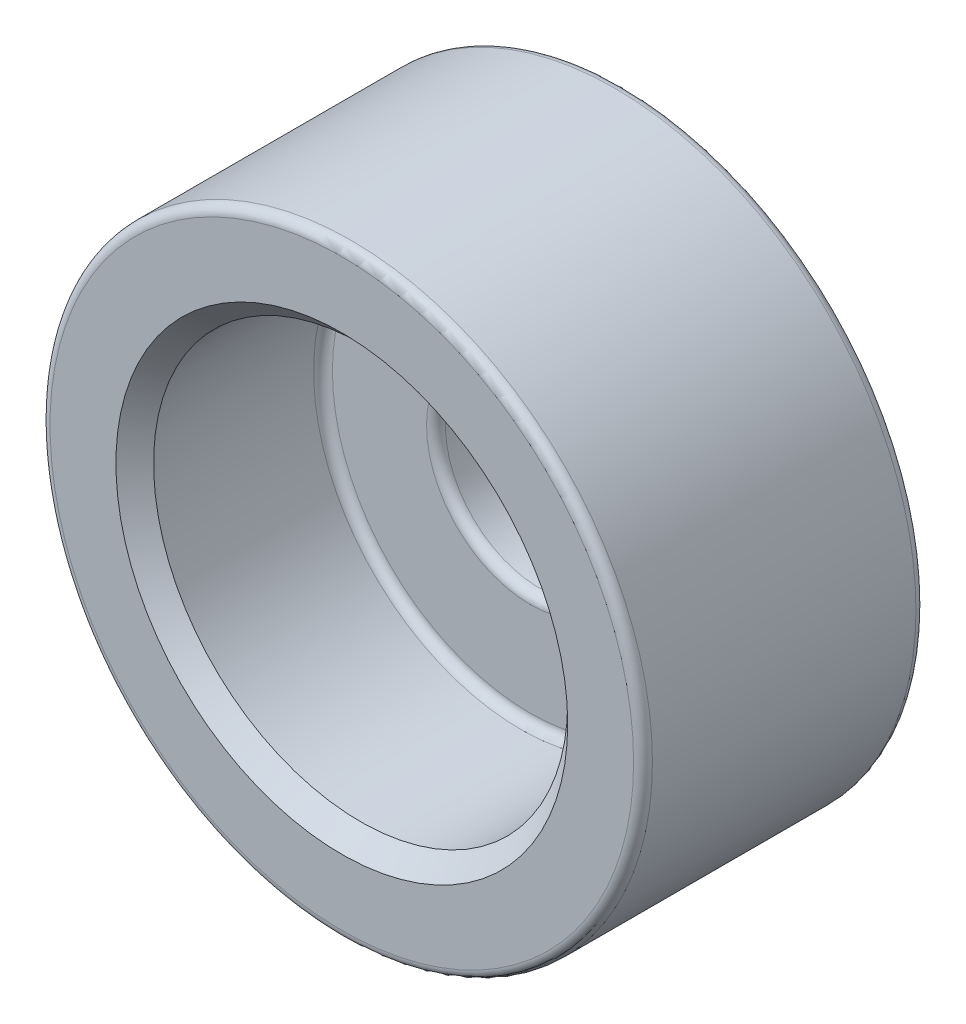
ISO-10303-21;
HEADER;
FILE_DESCRIPTION(('STEP AP214'),'2;1');
FILE_NAME('part.step','',(''),(''),'','','');
FILE_SCHEMA(('AUTOMOTIVE_DESIGN { 1 0 10303 214 1 1 1 1 }'));
ENDSEC;
DATA;
#1=APPLICATION_CONTEXT('core data for automotive mechanical design processes');
#2=APPLICATION_PROTOCOL_DEFINITION('international standard','automotive_design',2000,#1);
#3=PRODUCT_CONTEXT('',#1,'mechanical');
#4=PRODUCT('Part','Part','',(#3));
#5=PRODUCT_RELATED_PRODUCT_CATEGORY('part','',(#4));
#6=PRODUCT_DEFINITION_FORMATION('','',#4);
#7=PRODUCT_DEFINITION_CONTEXT('part definition',#1,'design');
#8=PRODUCT_DEFINITION('design','',#6,#7);
#9=PRODUCT_DEFINITION_SHAPE('','',#8);
#10=(LENGTH_UNIT() NAMED_UNIT(*) SI_UNIT(.MILLI.,.METRE.));
#11=(NAMED_UNIT(*) PLANE_ANGLE_UNIT() SI_UNIT($,.RADIAN.));
#12=(NAMED_UNIT(*) SI_UNIT($,.STERADIAN.) SOLID_ANGLE_UNIT());
#13=UNCERTAINTY_MEASURE_WITH_UNIT(LENGTH_MEASURE(1.E-05),#10,'distance_accuracy_value','');
#14=(GEOMETRIC_REPRESENTATION_CONTEXT(3) GLOBAL_UNCERTAINTY_ASSIGNED_CONTEXT((#13)) GLOBAL_UNIT_ASSIGNED_CONTEXT((#10,
#11,#12)) REPRESENTATION_CONTEXT('',''));
#15=CARTESIAN_POINT('',(0.,0.,0.));
#16=DIRECTION('',(0.,0.,1.));
#17=DIRECTION('',(1.,0.,0.));
#18=AXIS2_PLACEMENT_3D('',#15,#16,#17);
#19=CARTESIAN_POINT('',(1.66533453693773E-13,0.,14.9999999999995));
#20=DIRECTION('',(0.,0.,-0.999999999999998));
#21=DIRECTION('',(-0.999999999999998,0.,0.));
#22=AXIS2_PLACEMENT_3D('',#19,#20,#21);
#23=CYLINDRICAL_SURFACE('',#22,16.);
#24=CARTESIAN_POINT('',(3.33066907387547E-13,0.,14.4999999999993));
#25=DIRECTION('',(0.,0.,0.999999999999998));
#26=DIRECTION('',(0.999999999999998,0.,0.));
#27=AXIS2_PLACEMENT_3D('',#24,#25,#26);
#28=CIRCLE('',#27,16.);
#29=CARTESIAN_POINT('',(16.0000000000003,0.,14.4999999999993));
#30=VERTEX_POINT('',#29);
#31=EDGE_CURVE('E65',#30,#30,#28,.F.);
#32=ORIENTED_EDGE('',*,*,#31,.T.);
#33=EDGE_LOOP('',(#32));
#34=FACE_BOUND('',#33,.T.);
#35=CARTESIAN_POINT('',(0.,0.,0.499999999999945));
#36=DIRECTION('',(0.,0.,0.999999999999998));
#37=DIRECTION('',(0.999999999999998,0.,0.));
#38=AXIS2_PLACEMENT_3D('',#35,#36,#37);
#39=CIRCLE('',#38,16.);
#40=CARTESIAN_POINT('',(16.,0.,0.499999999999945));
#41=VERTEX_POINT('',#40);
#42=EDGE_CURVE('E68',#41,#41,#39,.T.);
#43=ORIENTED_EDGE('',*,*,#42,.T.);
#44=EDGE_LOOP('',(#43));
#45=FACE_BOUND('',#44,.T.);
#46=ADVANCED_FACE('F36',(#34,#45),#23,.T.);
#47=CARTESIAN_POINT('',(1.66533453693773E-13,0.,14.9999999999995));
#48=DIRECTION('',(0.,0.,0.999999999999998));
#49=DIRECTION('',(0.999999999999998,0.,0.));
#50=AXIS2_PLACEMENT_3D('',#47,#48,#49);
#51=PLANE('',#50);
#52=CARTESIAN_POINT('',(1.66533453693773E-13,0.,14.9999999999995));
#53=DIRECTION('',(0.,0.,0.999999999999998));
#54=DIRECTION('',(0.999999999999998,0.,0.));
#55=AXIS2_PLACEMENT_3D('',#52,#53,#54);
#56=CIRCLE('',#55,15.5);
#57=CARTESIAN_POINT('',(15.5000000000001,0.,14.9999999999995));
#58=VERTEX_POINT('',#57);
#59=EDGE_CURVE('E71',#58,#58,#56,.T.);
#60=ORIENTED_EDGE('',*,*,#59,.T.);
#61=EDGE_LOOP('',(#60));
#62=FACE_BOUND('',#61,.T.);
#63=CARTESIAN_POINT('',(1.66533453693773E-13,0.,14.9999999999995));
#64=DIRECTION('',(0.,0.,0.999999999999998));
#65=DIRECTION('',(0.999999999999998,0.,0.));
#66=AXIS2_PLACEMENT_3D('',#63,#64,#65);
#67=CIRCLE('',#66,12.);
#68=CARTESIAN_POINT('',(12.0000000000002,0.,14.9999999999995));
#69=VERTEX_POINT('',#68);
#70=EDGE_CURVE('E74',#69,#69,#67,.F.);
#71=ORIENTED_EDGE('',*,*,#70,.T.);
#72=EDGE_LOOP('',(#71));
#73=FACE_BOUND('',#72,.T.);
#74=ADVANCED_FACE('F102',(#62,#73),#51,.T.);
#75=CARTESIAN_POINT('',(0.,0.,0.));
#76=DIRECTION('',(0.,0.,0.999999999999998));
#77=DIRECTION('',(0.999999999999998,0.,0.));
#78=AXIS2_PLACEMENT_3D('',#75,#76,#77);
#79=PLANE('',#78);
#80=CARTESIAN_POINT('',(0.,0.,0.));
#81=DIRECTION('',(0.,0.,0.999999999999998));
#82=DIRECTION('',(0.999999999999998,0.,0.));
#83=AXIS2_PLACEMENT_3D('',#80,#81,#82);
#84=CIRCLE('',#83,15.5);
#85=CARTESIAN_POINT('',(15.5,0.,0.));
#86=VERTEX_POINT('',#85);
#87=EDGE_CURVE('E59',#86,#86,#84,.F.);
#88=ORIENTED_EDGE('',*,*,#87,.T.);
#89=EDGE_LOOP('',(#88));
#90=FACE_BOUND('',#89,.T.);
#91=CARTESIAN_POINT('',(0.,0.,0.));
#92=DIRECTION('',(0.,0.,0.999999999999998));
#93=DIRECTION('',(0.999999999999998,0.,0.));
#94=AXIS2_PLACEMENT_3D('',#91,#92,#93);
#95=CIRCLE('',#94,5.5);
#96=CARTESIAN_POINT('',(5.49999999999999,0.,0.));
#97=VERTEX_POINT('',#96);
#98=EDGE_CURVE('E62',#97,#97,#95,.T.);
#99=ORIENTED_EDGE('',*,*,#98,.T.);
#100=EDGE_LOOP('',(#99));
#101=FACE_BOUND('',#100,.T.);
#102=ADVANCED_FACE('F107',(#90,#101),#79,.F.);
#103=CARTESIAN_POINT('',(-3.05311331771918E-13,0.,5.));
#104=DIRECTION('',(0.,0.,0.999999999999998));
#105=DIRECTION('',(0.999999999999998,0.,0.));
#106=AXIS2_PLACEMENT_3D('',#103,#104,#105);
#107=CYLINDRICAL_SURFACE('',#106,11.);
#108=CARTESIAN_POINT('',(-4.71844785465692E-13,0.,5.49999999999939));
#109=DIRECTION('',(0.,0.,0.999999999999998));
#110=DIRECTION('',(0.999999999999998,0.,0.));
#111=AXIS2_PLACEMENT_3D('',#108,#109,#110);
#112=CIRCLE('',#111,11.);
#113=CARTESIAN_POINT('',(10.9999999999995,0.,5.49999999999939));
#114=VERTEX_POINT('',#113);
#115=EDGE_CURVE('E10',#114,#114,#112,.F.);
#116=ORIENTED_EDGE('',*,*,#115,.T.);
#117=EDGE_LOOP('',(#116));
#118=FACE_BOUND('',#117,.T.);
#119=CARTESIAN_POINT('',(0.,0.,13.9999999999993));
#120=DIRECTION('',(0.,0.,0.999999999999998));
#121=DIRECTION('',(0.999999999999998,0.,0.));
#122=AXIS2_PLACEMENT_3D('',#119,#120,#121);
#123=CIRCLE('',#122,11.);
#124=CARTESIAN_POINT('',(11.,0.,13.9999999999993));
#125=VERTEX_POINT('',#124);
#126=EDGE_CURVE('E77',#125,#125,#123,.T.);
#127=ORIENTED_EDGE('',*,*,#126,.T.);
#128=EDGE_LOOP('',(#127));
#129=FACE_BOUND('',#128,.T.);
#130=ADVANCED_FACE('F81',(#118,#129),#107,.F.);
#131=CARTESIAN_POINT('',(-3.05311331771918E-13,0.,5.));
#132=DIRECTION('',(0.,0.,0.999999999999998));
#133=DIRECTION('',(0.999999999999998,0.,0.));
#134=AXIS2_PLACEMENT_3D('',#131,#132,#133);
#135=PLANE('',#134);
#136=CARTESIAN_POINT('',(-3.05311331771918E-13,0.,5.));
#137=DIRECTION('',(0.,0.,0.999999999999998));
#138=DIRECTION('',(0.999999999999998,0.,0.));
#139=AXIS2_PLACEMENT_3D('',#136,#137,#138);
#140=CIRCLE('',#139,5.5);
#141=CARTESIAN_POINT('',(5.49999999999968,0.,5.));
#142=VERTEX_POINT('',#141);
#143=EDGE_CURVE('E43',#142,#142,#140,.F.);
#144=ORIENTED_EDGE('',*,*,#143,.T.);
#145=EDGE_LOOP('',(#144));
#146=FACE_BOUND('',#145,.T.);
#147=CARTESIAN_POINT('',(-3.05311331771918E-13,0.,5.));
#148=DIRECTION('',(0.,0.,0.999999999999998));
#149=DIRECTION('',(0.999999999999998,0.,0.));
#150=AXIS2_PLACEMENT_3D('',#147,#148,#149);
#151=CIRCLE('',#150,10.5);
#152=CARTESIAN_POINT('',(10.4999999999997,0.,5.));
#153=VERTEX_POINT('',#152);
#154=EDGE_CURVE('E47',#153,#153,#151,.T.);
#155=ORIENTED_EDGE('',*,*,#154,.T.);
#156=EDGE_LOOP('',(#155));
#157=FACE_BOUND('',#156,.T.);
#158=ADVANCED_FACE('F96',(#146,#157),#135,.T.);
#159=CARTESIAN_POINT('',(-1.38777878078145E-13,0.,-14.1421356237309));
#160=DIRECTION('',(0.,0.,0.999999999999998));
#161=DIRECTION('',(0.999999999999998,0.,0.));
#162=AXIS2_PLACEMENT_3D('',#159,#160,#161);
#163=CYLINDRICAL_SURFACE('',#162,5.);
#164=CARTESIAN_POINT('',(0.,0.,0.499999999999945));
#165=DIRECTION('',(0.,0.,0.999999999999998));
#166=DIRECTION('',(0.999999999999998,0.,0.));
#167=AXIS2_PLACEMENT_3D('',#164,#165,#166);
#168=CIRCLE('',#167,5.);
#169=CARTESIAN_POINT('',(5.00000000000002,0.,0.499999999999945));
#170=VERTEX_POINT('',#169);
#171=EDGE_CURVE('E51',#170,#170,#168,.F.);
#172=ORIENTED_EDGE('',*,*,#171,.T.);
#173=EDGE_LOOP('',(#172));
#174=FACE_BOUND('',#173,.T.);
#175=CARTESIAN_POINT('',(-3.05311331771918E-13,0.,4.49999999999995));
#176=DIRECTION('',(0.,0.,0.999999999999998));
#177=DIRECTION('',(0.999999999999998,0.,0.));
#178=AXIS2_PLACEMENT_3D('',#175,#176,#177);
#179=CIRCLE('',#178,5.);
#180=CARTESIAN_POINT('',(4.99999999999968,0.,4.49999999999995));
#181=VERTEX_POINT('',#180);
#182=EDGE_CURVE('E56',#181,#181,#179,.T.);
#183=ORIENTED_EDGE('',*,*,#182,.T.);
#184=EDGE_LOOP('',(#183));
#185=FACE_BOUND('',#184,.T.);
#186=ADVANCED_FACE('F86',(#174,#185),#163,.F.);
#187=CARTESIAN_POINT('',(0.,0.,13.9999999999993));
#188=DIRECTION('',(0.,0.,0.999999999999998));
#189=DIRECTION('',(0.999999999999998,0.,0.));
#190=AXIS2_PLACEMENT_3D('',#187,#188,#189);
#191=CONICAL_SURFACE('',#190,11.,0.78539816339745);
#192=ORIENTED_EDGE('',*,*,#70,.F.);
#193=EDGE_LOOP('',(#192));
#194=FACE_BOUND('',#193,.T.);
#195=ORIENTED_EDGE('',*,*,#126,.F.);
#196=EDGE_LOOP('',(#195));
#197=FACE_BOUND('',#196,.T.);
#198=ADVANCED_FACE('F83',(#194,#197),#191,.F.);
#199=CARTESIAN_POINT('',(3.33066907387547E-13,0.,14.4999999999993));
#200=DIRECTION('',(0.,0.,0.999999999999998));
#201=DIRECTION('',(0.999999999999998,0.,0.));
#202=AXIS2_PLACEMENT_3D('',#199,#200,#201);
#203=TOROIDAL_SURFACE('',#202,15.5,0.5);
#204=ORIENTED_EDGE('',*,*,#31,.F.);
#205=EDGE_LOOP('',(#204));
#206=FACE_BOUND('',#205,.T.);
#207=ORIENTED_EDGE('',*,*,#59,.F.);
#208=EDGE_LOOP('',(#207));
#209=FACE_BOUND('',#208,.T.);
#210=ADVANCED_FACE('F85',(#206,#209),#203,.T.);
#211=CARTESIAN_POINT('',(0.,0.,0.499999999999945));
#212=DIRECTION('',(0.,0.,0.999999999999998));
#213=DIRECTION('',(0.999999999999998,0.,0.));
#214=AXIS2_PLACEMENT_3D('',#211,#212,#213);
#215=TOROIDAL_SURFACE('',#214,15.5,0.5);
#216=ORIENTED_EDGE('',*,*,#87,.F.);
#217=EDGE_LOOP('',(#216));
#218=FACE_BOUND('',#217,.T.);
#219=ORIENTED_EDGE('',*,*,#42,.F.);
#220=EDGE_LOOP('',(#219));
#221=FACE_BOUND('',#220,.T.);
#222=ADVANCED_FACE('F93',(#218,#221),#215,.T.);
#223=CARTESIAN_POINT('',(0.,0.,0.499999999999945));
#224=DIRECTION('',(0.,0.,0.999999999999998));
#225=DIRECTION('',(0.999999999999998,0.,0.));
#226=AXIS2_PLACEMENT_3D('',#223,#224,#225);
#227=TOROIDAL_SURFACE('',#226,5.5,0.5);
#228=ORIENTED_EDGE('',*,*,#98,.F.);
#229=EDGE_LOOP('',(#228));
#230=FACE_BOUND('',#229,.T.);
#231=ORIENTED_EDGE('',*,*,#171,.F.);
#232=EDGE_LOOP('',(#231));
#233=FACE_BOUND('',#232,.T.);
#234=ADVANCED_FACE('F129',(#230,#233),#227,.T.);
#235=CARTESIAN_POINT('',(-3.05311331771918E-13,0.,4.49999999999995));
#236=DIRECTION('',(0.,0.,0.999999999999998));
#237=DIRECTION('',(0.999999999999998,0.,0.));
#238=AXIS2_PLACEMENT_3D('',#235,#236,#237);
#239=TOROIDAL_SURFACE('',#238,5.5,0.5);
#240=ORIENTED_EDGE('',*,*,#143,.F.);
#241=EDGE_LOOP('',(#240));
#242=FACE_BOUND('',#241,.T.);
#243=ORIENTED_EDGE('',*,*,#182,.F.);
#244=EDGE_LOOP('',(#243));
#245=FACE_BOUND('',#244,.T.);
#246=ADVANCED_FACE('F124',(#242,#245),#239,.T.);
#247=CARTESIAN_POINT('',(-4.71844785465692E-13,0.,5.49999999999939));
#248=DIRECTION('',(0.,0.,0.999999999999998));
#249=DIRECTION('',(0.999999999999998,0.,0.));
#250=AXIS2_PLACEMENT_3D('',#247,#248,#249);
#251=TOROIDAL_SURFACE('',#250,10.5,0.5);
#252=ORIENTED_EDGE('',*,*,#115,.F.);
#253=EDGE_LOOP('',(#252));
#254=FACE_BOUND('',#253,.T.);
#255=ORIENTED_EDGE('',*,*,#154,.F.);
#256=EDGE_LOOP('',(#255));
#257=FACE_BOUND('',#256,.T.);
#258=ADVANCED_FACE('F38',(#254,#257),#251,.F.);
#259=CLOSED_SHELL('',(#46,#74,#102,#130,#158,#186,#198,#210,#222,#234,#246,#258));
#260=MANIFOLD_SOLID_BREP('B2',#259);
#261=ADVANCED_BREP_SHAPE_REPRESENTATION('',(#18,#260),#14);
#262=SHAPE_DEFINITION_REPRESENTATION(#9,#261);
ENDSEC;
END-ISO-10303-21;
